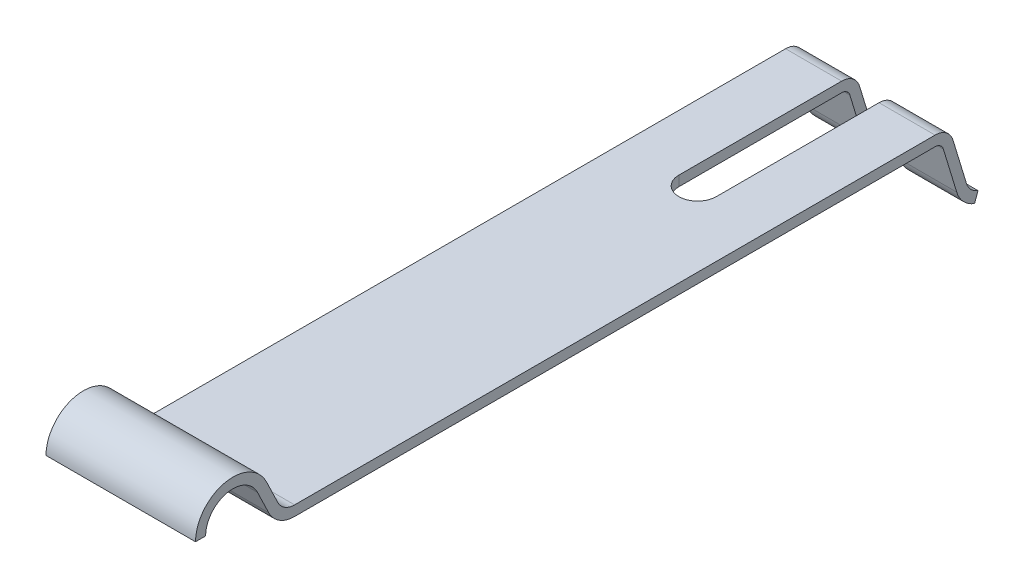
ISO-10303-21;
HEADER;
FILE_DESCRIPTION(('STEP AP214'),'2;1');
FILE_NAME('part.step','',(''),(''),'','','');
FILE_SCHEMA(('AUTOMOTIVE_DESIGN { 1 0 10303 214 1 1 1 1 }'));
ENDSEC;
DATA;
#1=APPLICATION_CONTEXT('core data for automotive mechanical design processes');
#2=APPLICATION_PROTOCOL_DEFINITION('international standard','automotive_design',2000,#1);
#3=PRODUCT_CONTEXT('',#1,'mechanical');
#4=PRODUCT('Part','Part','',(#3));
#5=PRODUCT_RELATED_PRODUCT_CATEGORY('part','',(#4));
#6=PRODUCT_DEFINITION_FORMATION('','',#4);
#7=PRODUCT_DEFINITION_CONTEXT('part definition',#1,'design');
#8=PRODUCT_DEFINITION('design','',#6,#7);
#9=PRODUCT_DEFINITION_SHAPE('','',#8);
#10=(LENGTH_UNIT() NAMED_UNIT(*) SI_UNIT(.MILLI.,.METRE.));
#11=(NAMED_UNIT(*) PLANE_ANGLE_UNIT() SI_UNIT($,.RADIAN.));
#12=(NAMED_UNIT(*) SI_UNIT($,.STERADIAN.) SOLID_ANGLE_UNIT());
#13=UNCERTAINTY_MEASURE_WITH_UNIT(LENGTH_MEASURE(1.E-05),#10,'distance_accuracy_value','');
#14=(GEOMETRIC_REPRESENTATION_CONTEXT(3) GLOBAL_UNCERTAINTY_ASSIGNED_CONTEXT((#13)) GLOBAL_UNIT_ASSIGNED_CONTEXT((#10,
#11,#12)) REPRESENTATION_CONTEXT('',''));
#15=CARTESIAN_POINT('',(0.,0.,0.));
#16=DIRECTION('',(0.,0.,1.));
#17=DIRECTION('',(1.,0.,0.));
#18=AXIS2_PLACEMENT_3D('',#15,#16,#17);
#19=CARTESIAN_POINT('',(4.,-0.499999999999997,-9.0351922261174));
#20=DIRECTION('',(-1.,0.,0.));
#21=DIRECTION('',(0.,0.,-1.));
#22=AXIS2_PLACEMENT_3D('',#19,#20,#21);
#23=CYLINDRICAL_SURFACE('',#22,0.499999999999997);
#24=DIRECTION('',(-1.,0.,0.));
#25=VECTOR('',#24,1.);
#26=CARTESIAN_POINT('',(4.,0.,-9.0351922261174));
#27=LINE('',#26,#25);
#28=CARTESIAN_POINT('',(4.,0.,-9.0351922261174));
#29=VERTEX_POINT('',#28);
#30=CARTESIAN_POINT('',(2.5,0.,-9.0351922261174));
#31=VERTEX_POINT('',#30);
#32=EDGE_CURVE('E239',#29,#31,#27,.T.);
#33=ORIENTED_EDGE('',*,*,#32,.F.);
#34=CARTESIAN_POINT('',(4.,-0.499999999999997,-9.0351922261174));
#35=DIRECTION('',(-1.,0.,0.));
#36=DIRECTION('',(0.,0.,1.));
#37=AXIS2_PLACEMENT_3D('',#34,#35,#36);
#38=CIRCLE('',#37,0.499999999999997);
#39=CARTESIAN_POINT('',(4.,-0.354575310744387,-9.51357665286529));
#40=VERTEX_POINT('',#39);
#41=EDGE_CURVE('E238',#29,#40,#38,.T.);
#42=ORIENTED_EDGE('',*,*,#41,.T.);
#43=DIRECTION('',(-1.,0.,0.));
#44=VECTOR('',#43,1.);
#45=CARTESIAN_POINT('',(4.,-0.354575310744387,-9.51357665286529));
#46=LINE('',#45,#44);
#47=CARTESIAN_POINT('',(2.5,-0.354575310744387,-9.51357665286529));
#48=VERTEX_POINT('',#47);
#49=EDGE_CURVE('E45',#40,#48,#46,.T.);
#50=ORIENTED_EDGE('',*,*,#49,.T.);
#51=CARTESIAN_POINT('',(2.5,-0.499999999999997,-9.0351922261174));
#52=DIRECTION('',(-1.,0.,0.));
#53=DIRECTION('',(0.,0.,1.));
#54=AXIS2_PLACEMENT_3D('',#51,#52,#53);
#55=CIRCLE('',#54,0.499999999999997);
#56=EDGE_CURVE('E342',#31,#48,#55,.T.);
#57=ORIENTED_EDGE('',*,*,#56,.F.);
#58=EDGE_LOOP('',(#33,#42,#50,#57));
#59=FACE_BOUND('',#58,.T.);
#60=ADVANCED_FACE('F37',(#59),#23,.T.);
#61=CARTESIAN_POINT('',(4.,-0.354575310744387,-9.51357665286529));
#62=DIRECTION('',(0.,-0.290849378511219,0.956768853495784));
#63=DIRECTION('',(0.,0.956768853495784,0.290849378511219));
#64=AXIS2_PLACEMENT_3D('',#61,#62,#63);
#65=PLANE('',#64);
#66=ORIENTED_EDGE('',*,*,#49,.F.);
#67=DIRECTION('',(0.,-0.956768853495784,-0.290849378511219));
#68=VECTOR('',#67,1.);
#69=CARTESIAN_POINT('',(4.,-0.354575310744387,-9.51357665286529));
#70=LINE('',#69,#68);
#71=CARTESIAN_POINT('',(4.,-1.53406037853968,-9.87212981612726));
#72=VERTEX_POINT('',#71);
#73=EDGE_CURVE('E126',#40,#72,#70,.T.);
#74=ORIENTED_EDGE('',*,*,#73,.T.);
#75=DIRECTION('',(-1.,0.,0.));
#76=VECTOR('',#75,1.);
#77=CARTESIAN_POINT('',(4.,-1.53406037853968,-9.87212981612726));
#78=LINE('',#77,#76);
#79=CARTESIAN_POINT('',(2.5,-1.53406037853968,-9.87212981612726));
#80=VERTEX_POINT('',#79);
#81=EDGE_CURVE('E279',#72,#80,#78,.T.);
#82=ORIENTED_EDGE('',*,*,#81,.T.);
#83=DIRECTION('',(0.,-0.956768853495784,-0.290849378511219));
#84=VECTOR('',#83,1.);
#85=CARTESIAN_POINT('',(2.5,-0.354575310744387,-9.51357665286529));
#86=LINE('',#85,#84);
#87=EDGE_CURVE('E338',#48,#80,#86,.T.);
#88=ORIENTED_EDGE('',*,*,#87,.F.);
#89=EDGE_LOOP('',(#66,#74,#82,#88));
#90=FACE_BOUND('',#89,.T.);
#91=ADVANCED_FACE('F340',(#90),#65,.F.);
#92=CARTESIAN_POINT('',(4.,-1.38863568928381,-10.3505142428752));
#93=DIRECTION('',(-1.,0.,0.));
#94=DIRECTION('',(0.,0.,-1.));
#95=AXIS2_PLACEMENT_3D('',#92,#93,#94);
#96=CYLINDRICAL_SURFACE('',#95,0.500000000000134);
#97=ORIENTED_EDGE('',*,*,#81,.F.);
#98=CARTESIAN_POINT('',(4.,-1.38863568928381,-10.3505142428752));
#99=DIRECTION('',(1.,0.,0.));
#100=DIRECTION('',(0.,0.,1.));
#101=AXIS2_PLACEMENT_3D('',#98,#99,#100);
#102=CIRCLE('',#101,0.500000000000134);
#103=CARTESIAN_POINT('',(4.,-1.85954456376847,-10.1824522545144));
#104=VERTEX_POINT('',#103);
#105=EDGE_CURVE('E354',#72,#104,#102,.T.);
#106=ORIENTED_EDGE('',*,*,#105,.T.);
#107=DIRECTION('',(-1.,0.,0.));
#108=VECTOR('',#107,1.);
#109=CARTESIAN_POINT('',(4.,-1.85954456376847,-10.1824522545144));
#110=LINE('',#109,#108);
#111=CARTESIAN_POINT('',(2.5,-1.85954456376847,-10.1824522545144));
#112=VERTEX_POINT('',#111);
#113=EDGE_CURVE('E275',#104,#112,#110,.T.);
#114=ORIENTED_EDGE('',*,*,#113,.T.);
#115=CARTESIAN_POINT('',(2.5,-1.38863568928381,-10.3505142428752));
#116=DIRECTION('',(-1.,0.,0.));
#117=DIRECTION('',(0.,0.,1.));
#118=AXIS2_PLACEMENT_3D('',#115,#116,#117);
#119=CIRCLE('',#118,0.500000000000134);
#120=EDGE_CURVE('E334',#80,#112,#119,.F.);
#121=ORIENTED_EDGE('',*,*,#120,.F.);
#122=EDGE_LOOP('',(#97,#106,#114,#121));
#123=FACE_BOUND('',#122,.T.);
#124=ADVANCED_FACE('F421',(#123),#96,.F.);
#125=CARTESIAN_POINT('',(4.,-2.11383535599007,-10.0916987807995));
#126=DIRECTION('',(0.,0.336123976721736,0.941817748968858));
#127=DIRECTION('',(0.,0.941817748968858,-0.336123976721736));
#128=AXIS2_PLACEMENT_3D('',#125,#126,#127);
#129=PLANE('',#128);
#130=ORIENTED_EDGE('',*,*,#113,.F.);
#131=DIRECTION('',(0.,-0.941817748968858,0.336123976721736));
#132=VECTOR('',#131,1.);
#133=CARTESIAN_POINT('',(4.,-2.11383535599007,-10.0916987807995));
#134=LINE('',#133,#132);
#135=CARTESIAN_POINT('',(4.,-2.11383535599007,-10.0916987807995));
#136=VERTEX_POINT('',#135);
#137=EDGE_CURVE('E357',#104,#136,#134,.T.);
#138=ORIENTED_EDGE('',*,*,#137,.T.);
#139=DIRECTION('',(-1.,0.,0.));
#140=VECTOR('',#139,1.);
#141=CARTESIAN_POINT('',(4.,-2.11383535599007,-10.0916987807995));
#142=LINE('',#141,#140);
#143=CARTESIAN_POINT('',(2.5,-2.11383535599007,-10.0916987807995));
#144=VERTEX_POINT('',#143);
#145=EDGE_CURVE('E271',#136,#144,#142,.T.);
#146=ORIENTED_EDGE('',*,*,#145,.T.);
#147=DIRECTION('',(0.,-0.941817748968858,0.336123976721736));
#148=VECTOR('',#147,1.);
#149=CARTESIAN_POINT('',(2.5,-2.11383535599007,-10.0916987807995));
#150=LINE('',#149,#148);
#151=EDGE_CURVE('E507',#112,#144,#150,.T.);
#152=ORIENTED_EDGE('',*,*,#151,.F.);
#153=EDGE_LOOP('',(#130,#138,#146,#152));
#154=FACE_BOUND('',#153,.T.);
#155=ADVANCED_FACE('F420',(#154),#129,.F.);
#156=CARTESIAN_POINT('',(4.,-1.38863568928404,-10.3505142428752));
#157=DIRECTION('',(-1.,0.,0.));
#158=DIRECTION('',(0.,0.,-1.));
#159=AXIS2_PLACEMENT_3D('',#156,#157,#158);
#160=CYLINDRICAL_SURFACE('',#159,0.770000000000012);
#161=ORIENTED_EDGE('',*,*,#145,.F.);
#162=CARTESIAN_POINT('',(4.,-1.38863568928404,-10.3505142428752));
#163=DIRECTION('',(-1.,0.,0.));
#164=DIRECTION('',(0.,0.,1.));
#165=AXIS2_PLACEMENT_3D('',#162,#163,#164);
#166=CIRCLE('',#165,0.770000000000012);
#167=CARTESIAN_POINT('',(4.,-1.61258971073768,-9.61380222568346));
#168=VERTEX_POINT('',#167);
#169=EDGE_CURVE('E360',#136,#168,#166,.T.);
#170=ORIENTED_EDGE('',*,*,#169,.T.);
#171=DIRECTION('',(-1.,0.,0.));
#172=VECTOR('',#171,1.);
#173=CARTESIAN_POINT('',(4.,-1.61258971073768,-9.61380222568346));
#174=LINE('',#173,#172);
#175=CARTESIAN_POINT('',(2.5,-1.61258971073768,-9.61380222568346));
#176=VERTEX_POINT('',#175);
#177=EDGE_CURVE('E267',#168,#176,#174,.T.);
#178=ORIENTED_EDGE('',*,*,#177,.T.);
#179=CARTESIAN_POINT('',(2.5,-1.38863568928404,-10.3505142428752));
#180=DIRECTION('',(-1.,0.,0.));
#181=DIRECTION('',(0.,0.,1.));
#182=AXIS2_PLACEMENT_3D('',#179,#180,#181);
#183=CIRCLE('',#182,0.770000000000012);
#184=EDGE_CURVE('E416',#144,#176,#183,.T.);
#185=ORIENTED_EDGE('',*,*,#184,.F.);
#186=EDGE_LOOP('',(#161,#170,#178,#185));
#187=FACE_BOUND('',#186,.T.);
#188=ADVANCED_FACE('F415',(#187),#160,.T.);
#189=CARTESIAN_POINT('',(4.,-0.433104642942421,-9.25524906242141));
#190=DIRECTION('',(0.,0.290849378511219,-0.956768853495784));
#191=DIRECTION('',(0.,-0.956768853495784,-0.290849378511219));
#192=AXIS2_PLACEMENT_3D('',#189,#190,#191);
#193=PLANE('',#192);
#194=ORIENTED_EDGE('',*,*,#177,.F.);
#195=DIRECTION('',(0.,0.956768853495784,0.290849378511219));
#196=VECTOR('',#195,1.);
#197=CARTESIAN_POINT('',(4.,-0.433104642942421,-9.25524906242141));
#198=LINE('',#197,#196);
#199=CARTESIAN_POINT('',(4.,-0.433104642942421,-9.25524906242141));
#200=VERTEX_POINT('',#199);
#201=EDGE_CURVE('E363',#168,#200,#198,.T.);
#202=ORIENTED_EDGE('',*,*,#201,.T.);
#203=DIRECTION('',(-1.,0.,0.));
#204=VECTOR('',#203,1.);
#205=CARTESIAN_POINT('',(4.,-0.433104642942421,-9.25524906242141));
#206=LINE('',#205,#204);
#207=CARTESIAN_POINT('',(2.5,-0.433104642942421,-9.25524906242141));
#208=VERTEX_POINT('',#207);
#209=EDGE_CURVE('E263',#200,#208,#206,.T.);
#210=ORIENTED_EDGE('',*,*,#209,.T.);
#211=DIRECTION('',(0.,0.956768853495784,0.290849378511219));
#212=VECTOR('',#211,1.);
#213=CARTESIAN_POINT('',(2.5,-0.433104642942421,-9.25524906242141));
#214=LINE('',#213,#212);
#215=EDGE_CURVE('E412',#176,#208,#214,.T.);
#216=ORIENTED_EDGE('',*,*,#215,.F.);
#217=EDGE_LOOP('',(#194,#202,#210,#216));
#218=FACE_BOUND('',#217,.T.);
#219=ADVANCED_FACE('F410',(#218),#193,.F.);
#220=CARTESIAN_POINT('',(4.,-0.499999999999997,-9.0351922261174));
#221=DIRECTION('',(-1.,0.,0.));
#222=DIRECTION('',(0.,0.,-1.));
#223=AXIS2_PLACEMENT_3D('',#220,#221,#222);
#224=CYLINDRICAL_SURFACE('',#223,0.229999999999984);
#225=ORIENTED_EDGE('',*,*,#209,.F.);
#226=CARTESIAN_POINT('',(4.,-0.499999999999997,-9.0351922261174));
#227=DIRECTION('',(1.,0.,0.));
#228=DIRECTION('',(0.,0.,1.));
#229=AXIS2_PLACEMENT_3D('',#226,#227,#228);
#230=CIRCLE('',#229,0.229999999999984);
#231=CARTESIAN_POINT('',(4.,-0.270000000000012,-9.0351922261174));
#232=VERTEX_POINT('',#231);
#233=EDGE_CURVE('E366',#200,#232,#230,.T.);
#234=ORIENTED_EDGE('',*,*,#233,.T.);
#235=DIRECTION('',(-1.,0.,0.));
#236=VECTOR('',#235,1.);
#237=CARTESIAN_POINT('',(4.,-0.270000000000012,-9.0351922261174));
#238=LINE('',#237,#236);
#239=CARTESIAN_POINT('',(2.5,-0.270000000000012,-9.0351922261174));
#240=VERTEX_POINT('',#239);
#241=EDGE_CURVE('E259',#232,#240,#238,.T.);
#242=ORIENTED_EDGE('',*,*,#241,.T.);
#243=CARTESIAN_POINT('',(2.5,-0.499999999999997,-9.0351922261174));
#244=DIRECTION('',(-1.,0.,0.));
#245=DIRECTION('',(0.,0.,1.));
#246=AXIS2_PLACEMENT_3D('',#243,#244,#245);
#247=CIRCLE('',#246,0.229999999999984);
#248=EDGE_CURVE('E503',#208,#240,#247,.F.);
#249=ORIENTED_EDGE('',*,*,#248,.F.);
#250=EDGE_LOOP('',(#225,#234,#242,#249));
#251=FACE_BOUND('',#250,.T.);
#252=ADVANCED_FACE('F406',(#251),#224,.F.);
#253=CARTESIAN_POINT('',(1.5,-0.354575310744387,-9.51357665286529));
#254=VERTEX_POINT('',#253);
#255=CARTESIAN_POINT('',(0.,-0.354575310744387,-9.51357665286529));
#256=VERTEX_POINT('',#255);
#257=EDGE_CURVE('E281',#254,#256,#46,.T.);
#258=ORIENTED_EDGE('',*,*,#257,.T.);
#259=CARTESIAN_POINT('',(0.,-0.499999999999997,-9.0351922261174));
#260=DIRECTION('',(-1.,0.,0.));
#261=DIRECTION('',(0.,0.,1.));
#262=AXIS2_PLACEMENT_3D('',#259,#260,#261);
#263=CIRCLE('',#262,0.499999999999997);
#264=CARTESIAN_POINT('',(0.,0.,-9.0351922261174));
#265=VERTEX_POINT('',#264);
#266=EDGE_CURVE('E195',#265,#256,#263,.T.);
#267=ORIENTED_EDGE('',*,*,#266,.F.);
#268=CARTESIAN_POINT('',(1.5,0.,-9.0351922261174));
#269=VERTEX_POINT('',#268);
#270=EDGE_CURVE('E194',#269,#265,#27,.T.);
#271=ORIENTED_EDGE('',*,*,#270,.F.);
#272=CARTESIAN_POINT('',(1.5,-0.499999999999997,-9.0351922261174));
#273=DIRECTION('',(1.,0.,0.));
#274=DIRECTION('',(0.,0.,-1.));
#275=AXIS2_PLACEMENT_3D('',#272,#273,#274);
#276=CIRCLE('',#275,0.499999999999997);
#277=EDGE_CURVE('E294',#254,#269,#276,.T.);
#278=ORIENTED_EDGE('',*,*,#277,.F.);
#279=EDGE_LOOP('',(#258,#267,#271,#278));
#280=FACE_BOUND('',#279,.T.);
#281=ADVANCED_FACE('F39',(#280),#23,.T.);
#282=CARTESIAN_POINT('',(1.5,-1.53406037853968,-9.87212981612726));
#283=VERTEX_POINT('',#282);
#284=CARTESIAN_POINT('',(0.,-1.53406037853968,-9.87212981612726));
#285=VERTEX_POINT('',#284);
#286=EDGE_CURVE('E278',#283,#285,#78,.T.);
#287=ORIENTED_EDGE('',*,*,#286,.T.);
#288=DIRECTION('',(0.,-0.956768853495784,-0.290849378511219));
#289=VECTOR('',#288,1.);
#290=CARTESIAN_POINT('',(0.,-0.354575310744387,-9.51357665286529));
#291=LINE('',#290,#289);
#292=EDGE_CURVE('E197',#256,#285,#291,.T.);
#293=ORIENTED_EDGE('',*,*,#292,.F.);
#294=ORIENTED_EDGE('',*,*,#257,.F.);
#295=DIRECTION('',(0.,0.956768853495784,0.290849378511219));
#296=VECTOR('',#295,1.);
#297=CARTESIAN_POINT('',(1.5,-0.354575310744387,-9.51357665286529));
#298=LINE('',#297,#296);
#299=EDGE_CURVE('E301',#283,#254,#298,.T.);
#300=ORIENTED_EDGE('',*,*,#299,.F.);
#301=EDGE_LOOP('',(#287,#293,#294,#300));
#302=FACE_BOUND('',#301,.T.);
#303=ADVANCED_FACE('F298',(#302),#65,.F.);
#304=CARTESIAN_POINT('',(1.5,-1.85954456376847,-10.1824522545144));
#305=VERTEX_POINT('',#304);
#306=CARTESIAN_POINT('',(0.,-1.85954456376847,-10.1824522545144));
#307=VERTEX_POINT('',#306);
#308=EDGE_CURVE('E274',#305,#307,#110,.T.);
#309=ORIENTED_EDGE('',*,*,#308,.T.);
#310=CARTESIAN_POINT('',(0.,-1.38863568928381,-10.3505142428752));
#311=DIRECTION('',(1.,0.,0.));
#312=DIRECTION('',(0.,0.,1.));
#313=AXIS2_PLACEMENT_3D('',#310,#311,#312);
#314=CIRCLE('',#313,0.500000000000134);
#315=EDGE_CURVE('E201',#285,#307,#314,.T.);
#316=ORIENTED_EDGE('',*,*,#315,.F.);
#317=ORIENTED_EDGE('',*,*,#286,.F.);
#318=CARTESIAN_POINT('',(1.5,-1.38863568928381,-10.3505142428752));
#319=DIRECTION('',(1.,0.,0.));
#320=DIRECTION('',(0.,0.,-1.));
#321=AXIS2_PLACEMENT_3D('',#318,#319,#320);
#322=CIRCLE('',#321,0.500000000000134);
#323=EDGE_CURVE('E496',#305,#283,#322,.F.);
#324=ORIENTED_EDGE('',*,*,#323,.F.);
#325=EDGE_LOOP('',(#309,#316,#317,#324));
#326=FACE_BOUND('',#325,.T.);
#327=ADVANCED_FACE('F424',(#326),#96,.F.);
#328=CARTESIAN_POINT('',(1.5,-2.11383535599007,-10.0916987807995));
#329=VERTEX_POINT('',#328);
#330=CARTESIAN_POINT('',(0.,-2.11383535599007,-10.0916987807995));
#331=VERTEX_POINT('',#330);
#332=EDGE_CURVE('E270',#329,#331,#142,.T.);
#333=ORIENTED_EDGE('',*,*,#332,.T.);
#334=DIRECTION('',(0.,-0.941817748968858,0.336123976721736));
#335=VECTOR('',#334,1.);
#336=CARTESIAN_POINT('',(0.,-2.11383535599007,-10.0916987807995));
#337=LINE('',#336,#335);
#338=EDGE_CURVE('E204',#307,#331,#337,.T.);
#339=ORIENTED_EDGE('',*,*,#338,.F.);
#340=ORIENTED_EDGE('',*,*,#308,.F.);
#341=DIRECTION('',(0.,0.941817748968858,-0.336123976721736));
#342=VECTOR('',#341,1.);
#343=CARTESIAN_POINT('',(1.5,-2.11383535599007,-10.0916987807995));
#344=LINE('',#343,#342);
#345=EDGE_CURVE('E483',#329,#305,#344,.T.);
#346=ORIENTED_EDGE('',*,*,#345,.F.);
#347=EDGE_LOOP('',(#333,#339,#340,#346));
#348=FACE_BOUND('',#347,.T.);
#349=ADVANCED_FACE('F430',(#348),#129,.F.);
#350=CARTESIAN_POINT('',(1.5,-1.61258971073768,-9.61380222568346));
#351=VERTEX_POINT('',#350);
#352=CARTESIAN_POINT('',(0.,-1.61258971073768,-9.61380222568346));
#353=VERTEX_POINT('',#352);
#354=EDGE_CURVE('E266',#351,#353,#174,.T.);
#355=ORIENTED_EDGE('',*,*,#354,.T.);
#356=CARTESIAN_POINT('',(0.,-1.38863568928404,-10.3505142428752));
#357=DIRECTION('',(-1.,0.,0.));
#358=DIRECTION('',(0.,0.,1.));
#359=AXIS2_PLACEMENT_3D('',#356,#357,#358);
#360=CIRCLE('',#359,0.770000000000012);
#361=EDGE_CURVE('E207',#331,#353,#360,.T.);
#362=ORIENTED_EDGE('',*,*,#361,.F.);
#363=ORIENTED_EDGE('',*,*,#332,.F.);
#364=CARTESIAN_POINT('',(1.5,-1.38863568928404,-10.3505142428752));
#365=DIRECTION('',(1.,0.,0.));
#366=DIRECTION('',(0.,0.,-1.));
#367=AXIS2_PLACEMENT_3D('',#364,#365,#366);
#368=CIRCLE('',#367,0.770000000000012);
#369=EDGE_CURVE('E480',#351,#329,#368,.T.);
#370=ORIENTED_EDGE('',*,*,#369,.F.);
#371=EDGE_LOOP('',(#355,#362,#363,#370));
#372=FACE_BOUND('',#371,.T.);
#373=ADVANCED_FACE('F455',(#372),#160,.T.);
#374=CARTESIAN_POINT('',(1.5,-0.433104642942421,-9.25524906242141));
#375=VERTEX_POINT('',#374);
#376=CARTESIAN_POINT('',(0.,-0.433104642942421,-9.25524906242141));
#377=VERTEX_POINT('',#376);
#378=EDGE_CURVE('E262',#375,#377,#206,.T.);
#379=ORIENTED_EDGE('',*,*,#378,.T.);
#380=DIRECTION('',(0.,0.956768853495784,0.290849378511219));
#381=VECTOR('',#380,1.);
#382=CARTESIAN_POINT('',(0.,-0.433104642942421,-9.25524906242141));
#383=LINE('',#382,#381);
#384=EDGE_CURVE('E210',#353,#377,#383,.T.);
#385=ORIENTED_EDGE('',*,*,#384,.F.);
#386=ORIENTED_EDGE('',*,*,#354,.F.);
#387=DIRECTION('',(0.,-0.956768853495784,-0.290849378511219));
#388=VECTOR('',#387,1.);
#389=CARTESIAN_POINT('',(1.5,-0.433104642942421,-9.25524906242141));
#390=LINE('',#389,#388);
#391=EDGE_CURVE('E486',#375,#351,#390,.T.);
#392=ORIENTED_EDGE('',*,*,#391,.F.);
#393=EDGE_LOOP('',(#379,#385,#386,#392));
#394=FACE_BOUND('',#393,.T.);
#395=ADVANCED_FACE('F447',(#394),#193,.F.);
#396=CARTESIAN_POINT('',(1.5,-0.270000000000012,-9.0351922261174));
#397=VERTEX_POINT('',#396);
#398=CARTESIAN_POINT('',(0.,-0.270000000000012,-9.0351922261174));
#399=VERTEX_POINT('',#398);
#400=EDGE_CURVE('E258',#397,#399,#238,.T.);
#401=ORIENTED_EDGE('',*,*,#400,.T.);
#402=CARTESIAN_POINT('',(0.,-0.499999999999997,-9.0351922261174));
#403=DIRECTION('',(1.,0.,0.));
#404=DIRECTION('',(0.,0.,1.));
#405=AXIS2_PLACEMENT_3D('',#402,#403,#404);
#406=CIRCLE('',#405,0.229999999999984);
#407=EDGE_CURVE('E213',#377,#399,#406,.T.);
#408=ORIENTED_EDGE('',*,*,#407,.F.);
#409=ORIENTED_EDGE('',*,*,#378,.F.);
#410=CARTESIAN_POINT('',(1.5,-0.499999999999997,-9.0351922261174));
#411=DIRECTION('',(1.,0.,0.));
#412=DIRECTION('',(0.,0.,-1.));
#413=AXIS2_PLACEMENT_3D('',#410,#411,#412);
#414=CIRCLE('',#413,0.229999999999984);
#415=EDGE_CURVE('E463',#397,#375,#414,.F.);
#416=ORIENTED_EDGE('',*,*,#415,.F.);
#417=EDGE_LOOP('',(#401,#408,#409,#416));
#418=FACE_BOUND('',#417,.T.);
#419=ADVANCED_FACE('F442',(#418),#224,.F.);
#420=CARTESIAN_POINT('',(4.,-0.270000000000012,-9.0351922261174));
#421=DIRECTION('',(0.,1.,0.));
#422=DIRECTION('',(0.,0.,-1.));
#423=AXIS2_PLACEMENT_3D('',#420,#421,#422);
#424=PLANE('',#423);
#425=ORIENTED_EDGE('',*,*,#241,.F.);
#426=DIRECTION('',(0.,0.,1.));
#427=VECTOR('',#426,1.);
#428=CARTESIAN_POINT('',(4.,-0.270000000000012,-9.0351922261174));
#429=LINE('',#428,#427);
#430=CARTESIAN_POINT('',(4.,-0.270000000000016,8.09786088611592));
#431=VERTEX_POINT('',#430);
#432=EDGE_CURVE('E369',#232,#431,#429,.T.);
#433=ORIENTED_EDGE('',*,*,#432,.T.);
#434=DIRECTION('',(-1.,0.,0.));
#435=VECTOR('',#434,1.);
#436=CARTESIAN_POINT('',(4.,-0.270000000000016,8.09786088611592));
#437=LINE('',#436,#435);
#438=CARTESIAN_POINT('',(0.,-0.270000000000016,8.09786088611592));
#439=VERTEX_POINT('',#438);
#440=EDGE_CURVE('E255',#431,#439,#437,.T.);
#441=ORIENTED_EDGE('',*,*,#440,.T.);
#442=DIRECTION('',(0.,0.,1.));
#443=VECTOR('',#442,1.);
#444=CARTESIAN_POINT('',(0.,-0.270000000000012,-9.0351922261174));
#445=LINE('',#444,#443);
#446=EDGE_CURVE('E216',#399,#439,#445,.T.);
#447=ORIENTED_EDGE('',*,*,#446,.F.);
#448=ORIENTED_EDGE('',*,*,#400,.F.);
#449=DIRECTION('',(0.,0.,-1.));
#450=VECTOR('',#449,1.);
#451=CARTESIAN_POINT('',(1.5,-0.270000000000012,-9.0351922261174));
#452=LINE('',#451,#450);
#453=CARTESIAN_POINT('',(1.5,-0.270000000000013,-4.68245225451435));
#454=VERTEX_POINT('',#453);
#455=EDGE_CURVE('E467',#454,#397,#452,.T.);
#456=ORIENTED_EDGE('',*,*,#455,.F.);
#457=CARTESIAN_POINT('',(2.,-0.270000000000013,-4.68245225451435));
#458=DIRECTION('',(0.,-1.,0.));
#459=DIRECTION('',(0.,0.,-1.));
#460=AXIS2_PLACEMENT_3D('',#457,#458,#459);
#461=CIRCLE('',#460,0.5);
#462=CARTESIAN_POINT('',(2.5,-0.270000000000013,-4.68245225451435));
#463=VERTEX_POINT('',#462);
#464=EDGE_CURVE('E198',#463,#454,#461,.T.);
#465=ORIENTED_EDGE('',*,*,#464,.F.);
#466=DIRECTION('',(0.,0.,1.));
#467=VECTOR('',#466,1.);
#468=CARTESIAN_POINT('',(2.5,-0.270000000000012,-9.0351922261174));
#469=LINE('',#468,#467);
#470=EDGE_CURVE('E402',#240,#463,#469,.T.);
#471=ORIENTED_EDGE('',*,*,#470,.F.);
#472=EDGE_LOOP('',(#425,#433,#441,#447,#448,#456,#465,#471));
#473=FACE_BOUND('',#472,.T.);
#474=ADVANCED_FACE('F399',(#473),#424,.F.);
#475=CARTESIAN_POINT('',(4.,0.499999999999997,8.09786088611592));
#476=DIRECTION('',(-1.,0.,0.));
#477=DIRECTION('',(0.,0.,-1.));
#478=AXIS2_PLACEMENT_3D('',#475,#476,#477);
#479=CYLINDRICAL_SURFACE('',#478,0.770000000000013);
#480=CARTESIAN_POINT('',(0.,0.499999999999997,8.09786088611592));
#481=DIRECTION('',(-1.,0.,0.));
#482=DIRECTION('',(0.,0.,1.));
#483=AXIS2_PLACEMENT_3D('',#480,#481,#482);
#484=CIRCLE('',#483,0.770000000000013);
#485=CARTESIAN_POINT('',(0.,0.166310550525428,8.79179989734773));
#486=VERTEX_POINT('',#485);
#487=EDGE_CURVE('E219',#439,#486,#484,.T.);
#488=ORIENTED_EDGE('',*,*,#487,.F.);
#489=ORIENTED_EDGE('',*,*,#440,.F.);
#490=CARTESIAN_POINT('',(4.,0.499999999999997,8.09786088611592));
#491=DIRECTION('',(-1.,0.,0.));
#492=DIRECTION('',(0.,0.,1.));
#493=AXIS2_PLACEMENT_3D('',#490,#491,#492);
#494=CIRCLE('',#493,0.770000000000013);
#495=CARTESIAN_POINT('',(4.,0.166310550525428,8.79179989734773));
#496=VERTEX_POINT('',#495);
#497=EDGE_CURVE('E372',#431,#496,#494,.T.);
#498=ORIENTED_EDGE('',*,*,#497,.T.);
#499=DIRECTION('',(-1.,0.,0.));
#500=VECTOR('',#499,1.);
#501=CARTESIAN_POINT('',(4.,0.166310550525428,8.79179989734773));
#502=LINE('',#501,#500);
#503=EDGE_CURVE('E252',#496,#486,#502,.T.);
#504=ORIENTED_EDGE('',*,*,#503,.T.);
#505=EDGE_LOOP('',(#488,#489,#498,#504));
#506=FACE_BOUND('',#505,.T.);
#507=ADVANCED_FACE('F397',(#506),#479,.T.);
#508=CARTESIAN_POINT('',(4.,0.166310550525428,8.79179989734773));
#509=DIRECTION('',(0.,0.433362921395535,-0.901219495106229));
#510=DIRECTION('',(0.,-0.90121949510623,-0.433362921395535));
#511=AXIS2_PLACEMENT_3D('',#508,#509,#510);
#512=PLANE('',#511);
#513=DIRECTION('',(0.,0.901219495106229,0.433362921395535));
#514=VECTOR('',#513,1.);
#515=CARTESIAN_POINT('',(0.,0.166310550525428,8.79179989734773));
#516=LINE('',#515,#514);
#517=CARTESIAN_POINT('',(0.,0.785534458083913,9.08956163356701));
#518=VERTEX_POINT('',#517);
#519=EDGE_CURVE('E222',#486,#518,#516,.T.);
#520=ORIENTED_EDGE('',*,*,#519,.F.);
#521=ORIENTED_EDGE('',*,*,#503,.F.);
#522=DIRECTION('',(0.,0.901219495106229,0.433362921395535));
#523=VECTOR('',#522,1.);
#524=CARTESIAN_POINT('',(4.,0.166310550525428,8.79179989734773));
#525=LINE('',#524,#523);
#526=CARTESIAN_POINT('',(4.,0.785534458083913,9.08956163356701));
#527=VERTEX_POINT('',#526);
#528=EDGE_CURVE('E375',#496,#527,#525,.T.);
#529=ORIENTED_EDGE('',*,*,#528,.T.);
#530=DIRECTION('',(-1.,0.,0.));
#531=VECTOR('',#530,1.);
#532=CARTESIAN_POINT('',(4.,0.785534458083913,9.08956163356701));
#533=LINE('',#532,#531);
#534=EDGE_CURVE('E249',#527,#518,#533,.T.);
#535=ORIENTED_EDGE('',*,*,#534,.T.);
#536=EDGE_LOOP('',(#520,#521,#529,#535));
#537=FACE_BOUND('',#536,.T.);
#538=ADVANCED_FACE('F393',(#537),#512,.F.);
#539=CARTESIAN_POINT('',(4.,0.469179525465173,9.74745186499455));
#540=DIRECTION('',(-1.,0.,0.));
#541=DIRECTION('',(0.,0.,-1.));
#542=AXIS2_PLACEMENT_3D('',#539,#540,#541);
#543=CYLINDRICAL_SURFACE('',#542,0.729999999999995);
#544=CARTESIAN_POINT('',(0.,0.469179525465173,9.74745186499455));
#545=DIRECTION('',(1.,0.,0.));
#546=DIRECTION('',(0.,0.,1.));
#547=AXIS2_PLACEMENT_3D('',#544,#545,#546);
#548=CIRCLE('',#547,0.729999999999995);
#549=CARTESIAN_POINT('',(0.,0.469179525465175,10.4774518649946));
#550=VERTEX_POINT('',#549);
#551=EDGE_CURVE('E225',#518,#550,#548,.T.);
#552=ORIENTED_EDGE('',*,*,#551,.F.);
#553=ORIENTED_EDGE('',*,*,#534,.F.);
#554=CARTESIAN_POINT('',(4.,0.469179525465173,9.74745186499455));
#555=DIRECTION('',(1.,0.,0.));
#556=DIRECTION('',(0.,0.,1.));
#557=AXIS2_PLACEMENT_3D('',#554,#555,#556);
#558=CIRCLE('',#557,0.729999999999995);
#559=CARTESIAN_POINT('',(4.,0.469179525465175,10.4774518649946));
#560=VERTEX_POINT('',#559);
#561=EDGE_CURVE('E378',#527,#560,#558,.T.);
#562=ORIENTED_EDGE('',*,*,#561,.T.);
#563=DIRECTION('',(-1.,0.,0.));
#564=VECTOR('',#563,1.);
#565=CARTESIAN_POINT('',(4.,0.469179525465175,10.4774518649946));
#566=LINE('',#565,#564);
#567=EDGE_CURVE('E246',#560,#550,#566,.T.);
#568=ORIENTED_EDGE('',*,*,#567,.T.);
#569=EDGE_LOOP('',(#552,#553,#562,#568));
#570=FACE_BOUND('',#569,.T.);
#571=ADVANCED_FACE('F390',(#570),#543,.F.);
#572=CARTESIAN_POINT('',(4.,0.469179525465175,10.4774518649946));
#573=DIRECTION('',(0.,1.,0.));
#574=DIRECTION('',(0.,0.,-1.));
#575=AXIS2_PLACEMENT_3D('',#572,#573,#574);
#576=PLANE('',#575);
#577=DIRECTION('',(0.,0.,1.));
#578=VECTOR('',#577,1.);
#579=CARTESIAN_POINT('',(0.,0.469179525465175,10.4774518649946));
#580=LINE('',#579,#578);
#581=CARTESIAN_POINT('',(0.,0.469179525465175,10.7474518649946));
#582=VERTEX_POINT('',#581);
#583=EDGE_CURVE('E228',#550,#582,#580,.T.);
#584=ORIENTED_EDGE('',*,*,#583,.F.);
#585=ORIENTED_EDGE('',*,*,#567,.F.);
#586=DIRECTION('',(0.,0.,1.));
#587=VECTOR('',#586,1.);
#588=CARTESIAN_POINT('',(4.,0.469179525465175,10.4774518649946));
#589=LINE('',#588,#587);
#590=CARTESIAN_POINT('',(4.,0.469179525465175,10.7474518649946));
#591=VERTEX_POINT('',#590);
#592=EDGE_CURVE('E189',#560,#591,#589,.T.);
#593=ORIENTED_EDGE('',*,*,#592,.T.);
#594=DIRECTION('',(-1.,0.,0.));
#595=VECTOR('',#594,1.);
#596=CARTESIAN_POINT('',(4.,0.469179525465175,10.7474518649946));
#597=LINE('',#596,#595);
#598=EDGE_CURVE('E243',#591,#582,#597,.T.);
#599=ORIENTED_EDGE('',*,*,#598,.T.);
#600=EDGE_LOOP('',(#584,#585,#593,#599));
#601=FACE_BOUND('',#600,.T.);
#602=ADVANCED_FACE('F383',(#601),#576,.F.);
#603=CARTESIAN_POINT('',(4.,0.469179525465175,9.74745186499456));
#604=DIRECTION('',(-1.,0.,0.));
#605=DIRECTION('',(0.,0.,-1.));
#606=AXIS2_PLACEMENT_3D('',#603,#604,#605);
#607=CYLINDRICAL_SURFACE('',#606,1.);
#608=CARTESIAN_POINT('',(0.,0.469179525465175,9.74745186499456));
#609=DIRECTION('',(-1.,0.,0.));
#610=DIRECTION('',(0.,0.,1.));
#611=AXIS2_PLACEMENT_3D('',#608,#609,#610);
#612=CIRCLE('',#611,1.);
#613=CARTESIAN_POINT('',(0.,0.90254244686071,8.84623236988832));
#614=VERTEX_POINT('',#613);
#615=EDGE_CURVE('E231',#582,#614,#612,.T.);
#616=ORIENTED_EDGE('',*,*,#615,.F.);
#617=ORIENTED_EDGE('',*,*,#598,.F.);
#618=CARTESIAN_POINT('',(4.,0.469179525465175,9.74745186499456));
#619=DIRECTION('',(-1.,0.,0.));
#620=DIRECTION('',(0.,0.,1.));
#621=AXIS2_PLACEMENT_3D('',#618,#619,#620);
#622=CIRCLE('',#621,1.);
#623=CARTESIAN_POINT('',(4.,0.90254244686071,8.84623236988832));
#624=VERTEX_POINT('',#623);
#625=EDGE_CURVE('E187',#591,#624,#622,.T.);
#626=ORIENTED_EDGE('',*,*,#625,.T.);
#627=DIRECTION('',(-1.,0.,0.));
#628=VECTOR('',#627,1.);
#629=CARTESIAN_POINT('',(4.,0.90254244686071,8.84623236988832));
#630=LINE('',#629,#628);
#631=EDGE_CURVE('E181',#624,#614,#630,.T.);
#632=ORIENTED_EDGE('',*,*,#631,.T.);
#633=EDGE_LOOP('',(#616,#617,#626,#632));
#634=FACE_BOUND('',#633,.T.);
#635=ADVANCED_FACE('F387',(#634),#607,.T.);
#636=CARTESIAN_POINT('',(4.,0.283318539302229,8.54847063366904));
#637=DIRECTION('',(0.,-0.433362921395537,0.901219495106228));
#638=DIRECTION('',(0.,0.901219495106229,0.433362921395537));
#639=AXIS2_PLACEMENT_3D('',#636,#637,#638);
#640=PLANE('',#639);
#641=DIRECTION('',(0.,-0.901219495106228,-0.433362921395537));
#642=VECTOR('',#641,1.);
#643=CARTESIAN_POINT('',(0.,0.283318539302229,8.54847063366904));
#644=LINE('',#643,#642);
#645=CARTESIAN_POINT('',(0.,0.283318539302228,8.54847063366904));
#646=VERTEX_POINT('',#645);
#647=EDGE_CURVE('E234',#614,#646,#644,.T.);
#648=ORIENTED_EDGE('',*,*,#647,.F.);
#649=ORIENTED_EDGE('',*,*,#631,.F.);
#650=DIRECTION('',(0.,-0.901219495106228,-0.433362921395537));
#651=VECTOR('',#650,1.);
#652=CARTESIAN_POINT('',(4.,0.283318539302229,8.54847063366904));
#653=LINE('',#652,#651);
#654=CARTESIAN_POINT('',(4.,0.283318539302228,8.54847063366904));
#655=VERTEX_POINT('',#654);
#656=EDGE_CURVE('E170',#624,#655,#653,.T.);
#657=ORIENTED_EDGE('',*,*,#656,.T.);
#658=DIRECTION('',(-1.,0.,0.));
#659=VECTOR('',#658,1.);
#660=CARTESIAN_POINT('',(4.,0.283318539302228,8.54847063366904));
#661=LINE('',#660,#659);
#662=EDGE_CURVE('E176',#655,#646,#661,.T.);
#663=ORIENTED_EDGE('',*,*,#662,.T.);
#664=EDGE_LOOP('',(#648,#649,#657,#663));
#665=FACE_BOUND('',#664,.T.);
#666=ADVANCED_FACE('F184',(#665),#640,.F.);
#667=CARTESIAN_POINT('',(4.,0.5,8.09786088611593));
#668=DIRECTION('',(-1.,0.,0.));
#669=DIRECTION('',(0.,0.,-1.));
#670=AXIS2_PLACEMENT_3D('',#667,#668,#669);
#671=CYLINDRICAL_SURFACE('',#670,0.499999999999998);
#672=CARTESIAN_POINT('',(0.,0.5,8.09786088611593));
#673=DIRECTION('',(1.,0.,0.));
#674=DIRECTION('',(0.,0.,1.));
#675=AXIS2_PLACEMENT_3D('',#672,#673,#674);
#676=CIRCLE('',#675,0.499999999999998);
#677=CARTESIAN_POINT('',(0.,0.,8.09786088611592));
#678=VERTEX_POINT('',#677);
#679=EDGE_CURVE('E178',#646,#678,#676,.T.);
#680=ORIENTED_EDGE('',*,*,#679,.F.);
#681=ORIENTED_EDGE('',*,*,#662,.F.);
#682=CARTESIAN_POINT('',(4.,0.5,8.09786088611593));
#683=DIRECTION('',(1.,0.,0.));
#684=DIRECTION('',(0.,0.,1.));
#685=AXIS2_PLACEMENT_3D('',#682,#683,#684);
#686=CIRCLE('',#685,0.499999999999998);
#687=CARTESIAN_POINT('',(4.,0.,8.09786088611592));
#688=VERTEX_POINT('',#687);
#689=EDGE_CURVE('E166',#655,#688,#686,.T.);
#690=ORIENTED_EDGE('',*,*,#689,.T.);
#691=DIRECTION('',(-1.,0.,0.));
#692=VECTOR('',#691,1.);
#693=CARTESIAN_POINT('',(4.,0.,8.09786088611592));
#694=LINE('',#693,#692);
#695=EDGE_CURVE('E182',#688,#678,#694,.T.);
#696=ORIENTED_EDGE('',*,*,#695,.T.);
#697=EDGE_LOOP('',(#680,#681,#690,#696));
#698=FACE_BOUND('',#697,.T.);
#699=ADVANCED_FACE('F177',(#698),#671,.F.);
#700=CARTESIAN_POINT('',(4.,0.,-9.0351922261174));
#701=DIRECTION('',(0.,-1.,0.));
#702=DIRECTION('',(0.,0.,1.));
#703=AXIS2_PLACEMENT_3D('',#700,#701,#702);
#704=PLANE('',#703);
#705=CARTESIAN_POINT('',(2.,0.,-4.68245225451435));
#706=DIRECTION('',(0.,-1.,0.));
#707=DIRECTION('',(0.,0.,-1.));
#708=AXIS2_PLACEMENT_3D('',#705,#706,#707);
#709=CIRCLE('',#708,0.5);
#710=CARTESIAN_POINT('',(2.5,0.,-4.68245225451435));
#711=VERTEX_POINT('',#710);
#712=CARTESIAN_POINT('',(1.5,0.,-4.68245225451435));
#713=VERTEX_POINT('',#712);
#714=EDGE_CURVE('E518',#711,#713,#709,.T.);
#715=ORIENTED_EDGE('',*,*,#714,.T.);
#716=DIRECTION('',(0.,0.,-1.));
#717=VECTOR('',#716,1.);
#718=CARTESIAN_POINT('',(1.5,0.,-4.68245225451435));
#719=LINE('',#718,#717);
#720=EDGE_CURVE('E516',#713,#269,#719,.T.);
#721=ORIENTED_EDGE('',*,*,#720,.T.);
#722=ORIENTED_EDGE('',*,*,#270,.T.);
#723=DIRECTION('',(0.,0.,-1.));
#724=VECTOR('',#723,1.);
#725=CARTESIAN_POINT('',(0.,0.,-9.0351922261174));
#726=LINE('',#725,#724);
#727=EDGE_CURVE('E118',#678,#265,#726,.T.);
#728=ORIENTED_EDGE('',*,*,#727,.F.);
#729=ORIENTED_EDGE('',*,*,#695,.F.);
#730=DIRECTION('',(0.,0.,-1.));
#731=VECTOR('',#730,1.);
#732=CARTESIAN_POINT('',(4.,0.,-9.0351922261174));
#733=LINE('',#732,#731);
#734=EDGE_CURVE('E61',#688,#29,#733,.T.);
#735=ORIENTED_EDGE('',*,*,#734,.T.);
#736=ORIENTED_EDGE('',*,*,#32,.T.);
#737=DIRECTION('',(0.,0.,-1.));
#738=VECTOR('',#737,1.);
#739=CARTESIAN_POINT('',(2.5,0.,-9.0351922261174));
#740=LINE('',#739,#738);
#741=EDGE_CURVE('E11',#711,#31,#740,.T.);
#742=ORIENTED_EDGE('',*,*,#741,.F.);
#743=EDGE_LOOP('',(#715,#721,#722,#728,#729,#735,#736,#742));
#744=FACE_BOUND('',#743,.T.);
#745=ADVANCED_FACE('F517',(#744),#704,.F.);
#746=CARTESIAN_POINT('',(4.,-0.499999999999997,-9.0351922261174));
#747=DIRECTION('',(1.,0.,0.));
#748=DIRECTION('',(0.,0.,1.));
#749=AXIS2_PLACEMENT_3D('',#746,#747,#748);
#750=PLANE('',#749);
#751=ORIENTED_EDGE('',*,*,#41,.F.);
#752=ORIENTED_EDGE('',*,*,#734,.F.);
#753=ORIENTED_EDGE('',*,*,#689,.F.);
#754=ORIENTED_EDGE('',*,*,#656,.F.);
#755=ORIENTED_EDGE('',*,*,#625,.F.);
#756=ORIENTED_EDGE('',*,*,#592,.F.);
#757=ORIENTED_EDGE('',*,*,#561,.F.);
#758=ORIENTED_EDGE('',*,*,#528,.F.);
#759=ORIENTED_EDGE('',*,*,#497,.F.);
#760=ORIENTED_EDGE('',*,*,#432,.F.);
#761=ORIENTED_EDGE('',*,*,#233,.F.);
#762=ORIENTED_EDGE('',*,*,#201,.F.);
#763=ORIENTED_EDGE('',*,*,#169,.F.);
#764=ORIENTED_EDGE('',*,*,#137,.F.);
#765=ORIENTED_EDGE('',*,*,#105,.F.);
#766=ORIENTED_EDGE('',*,*,#73,.F.);
#767=EDGE_LOOP('',(#751,#752,#753,#754,#755,#756,#757,#758,#759,#760,#761,#762,#763,#764,#765,#766));
#768=FACE_BOUND('',#767,.T.);
#769=ADVANCED_FACE('F168',(#768),#750,.T.);
#770=CARTESIAN_POINT('',(0.,-0.499999999999997,-9.0351922261174));
#771=DIRECTION('',(1.,0.,0.));
#772=DIRECTION('',(0.,0.,1.));
#773=AXIS2_PLACEMENT_3D('',#770,#771,#772);
#774=PLANE('',#773);
#775=ORIENTED_EDGE('',*,*,#266,.T.);
#776=ORIENTED_EDGE('',*,*,#292,.T.);
#777=ORIENTED_EDGE('',*,*,#315,.T.);
#778=ORIENTED_EDGE('',*,*,#338,.T.);
#779=ORIENTED_EDGE('',*,*,#361,.T.);
#780=ORIENTED_EDGE('',*,*,#384,.T.);
#781=ORIENTED_EDGE('',*,*,#407,.T.);
#782=ORIENTED_EDGE('',*,*,#446,.T.);
#783=ORIENTED_EDGE('',*,*,#487,.T.);
#784=ORIENTED_EDGE('',*,*,#519,.T.);
#785=ORIENTED_EDGE('',*,*,#551,.T.);
#786=ORIENTED_EDGE('',*,*,#583,.T.);
#787=ORIENTED_EDGE('',*,*,#615,.T.);
#788=ORIENTED_EDGE('',*,*,#647,.T.);
#789=ORIENTED_EDGE('',*,*,#679,.T.);
#790=ORIENTED_EDGE('',*,*,#727,.T.);
#791=EDGE_LOOP('',(#775,#776,#777,#778,#779,#780,#781,#782,#783,#784,#785,#786,#787,#788,#789,#790));
#792=FACE_BOUND('',#791,.T.);
#793=ADVANCED_FACE('F388',(#792),#774,.F.);
#794=CARTESIAN_POINT('',(2.,-4.15,-4.68245225451435));
#795=DIRECTION('',(0.,1.,0.));
#796=DIRECTION('',(0.,0.,-1.));
#797=AXIS2_PLACEMENT_3D('',#794,#795,#796);
#798=CYLINDRICAL_SURFACE('',#797,0.5);
#799=DIRECTION('',(0.,1.,0.));
#800=VECTOR('',#799,1.);
#801=CARTESIAN_POINT('',(2.5,-4.15,-4.68245225451435));
#802=LINE('',#801,#800);
#803=EDGE_CURVE('E509',#463,#711,#802,.T.);
#804=ORIENTED_EDGE('',*,*,#803,.F.);
#805=ORIENTED_EDGE('',*,*,#464,.T.);
#806=DIRECTION('',(0.,1.,0.));
#807=VECTOR('',#806,1.);
#808=CARTESIAN_POINT('',(1.5,-4.15,-4.68245225451435));
#809=LINE('',#808,#807);
#810=EDGE_CURVE('E52',#454,#713,#809,.T.);
#811=ORIENTED_EDGE('',*,*,#810,.T.);
#812=ORIENTED_EDGE('',*,*,#714,.F.);
#813=EDGE_LOOP('',(#804,#805,#811,#812));
#814=FACE_BOUND('',#813,.T.);
#815=ADVANCED_FACE('F510',(#814),#798,.F.);
#816=CARTESIAN_POINT('',(2.5,-4.15,-4.68245225451435));
#817=DIRECTION('',(1.,0.,0.));
#818=DIRECTION('',(0.,0.,1.));
#819=AXIS2_PLACEMENT_3D('',#816,#817,#818);
#820=PLANE('',#819);
#821=ORIENTED_EDGE('',*,*,#741,.T.);
#822=ORIENTED_EDGE('',*,*,#56,.T.);
#823=ORIENTED_EDGE('',*,*,#87,.T.);
#824=ORIENTED_EDGE('',*,*,#120,.T.);
#825=ORIENTED_EDGE('',*,*,#151,.T.);
#826=ORIENTED_EDGE('',*,*,#184,.T.);
#827=ORIENTED_EDGE('',*,*,#215,.T.);
#828=ORIENTED_EDGE('',*,*,#248,.T.);
#829=ORIENTED_EDGE('',*,*,#470,.T.);
#830=ORIENTED_EDGE('',*,*,#803,.T.);
#831=EDGE_LOOP('',(#821,#822,#823,#824,#825,#826,#827,#828,#829,#830));
#832=FACE_BOUND('',#831,.T.);
#833=ADVANCED_FACE('F344',(#832),#820,.F.);
#834=CARTESIAN_POINT('',(1.5,-4.15,-4.68245225451435));
#835=DIRECTION('',(-1.,0.,0.));
#836=DIRECTION('',(0.,0.,-1.));
#837=AXIS2_PLACEMENT_3D('',#834,#835,#836);
#838=PLANE('',#837);
#839=ORIENTED_EDGE('',*,*,#299,.T.);
#840=ORIENTED_EDGE('',*,*,#277,.T.);
#841=ORIENTED_EDGE('',*,*,#720,.F.);
#842=ORIENTED_EDGE('',*,*,#810,.F.);
#843=ORIENTED_EDGE('',*,*,#455,.T.);
#844=ORIENTED_EDGE('',*,*,#415,.T.);
#845=ORIENTED_EDGE('',*,*,#391,.T.);
#846=ORIENTED_EDGE('',*,*,#369,.T.);
#847=ORIENTED_EDGE('',*,*,#345,.T.);
#848=ORIENTED_EDGE('',*,*,#323,.T.);
#849=EDGE_LOOP('',(#839,#840,#841,#842,#843,#844,#845,#846,#847,#848));
#850=FACE_BOUND('',#849,.T.);
#851=ADVANCED_FACE('F482',(#850),#838,.F.);
#852=CLOSED_SHELL('',(#60,#91,#124,#155,#188,#219,#252,#281,#303,#327,#349,#373,#395,#419,#474,
#507,#538,#571,#602,#635,#666,#699,#745,#769,#793,#815,#833,#851));
#853=MANIFOLD_SOLID_BREP('B2',#852);
#854=ADVANCED_BREP_SHAPE_REPRESENTATION('',(#18,#853),#14);
#855=SHAPE_DEFINITION_REPRESENTATION(#9,#854);
ENDSEC;
END-ISO-10303-21;
